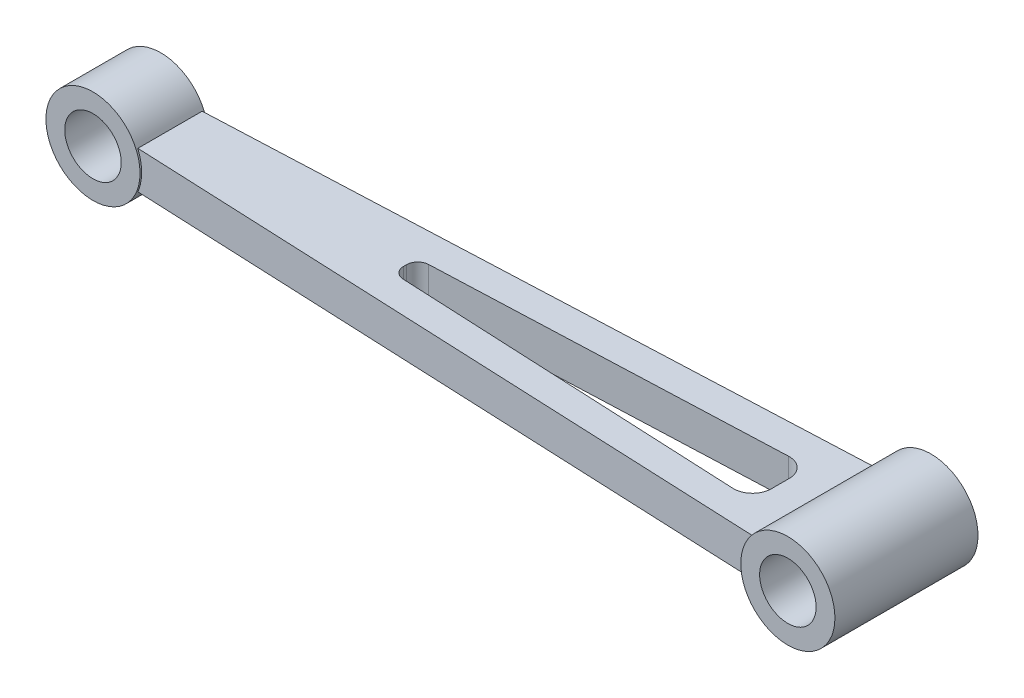
ISO-10303-21;
HEADER;
FILE_DESCRIPTION(('STEP AP214'),'2;1');
FILE_NAME('part.step','',(''),(''),'','','');
FILE_SCHEMA(('AUTOMOTIVE_DESIGN { 1 0 10303 214 1 1 1 1 }'));
ENDSEC;
DATA;
#1=APPLICATION_CONTEXT('core data for automotive mechanical design processes');
#2=APPLICATION_PROTOCOL_DEFINITION('international standard','automotive_design',2000,#1);
#3=PRODUCT_CONTEXT('',#1,'mechanical');
#4=PRODUCT('Part','Part','',(#3));
#5=PRODUCT_RELATED_PRODUCT_CATEGORY('part','',(#4));
#6=PRODUCT_DEFINITION_FORMATION('','',#4);
#7=PRODUCT_DEFINITION_CONTEXT('part definition',#1,'design');
#8=PRODUCT_DEFINITION('design','',#6,#7);
#9=PRODUCT_DEFINITION_SHAPE('','',#8);
#10=(LENGTH_UNIT() NAMED_UNIT(*) SI_UNIT(.MILLI.,.METRE.));
#11=(NAMED_UNIT(*) PLANE_ANGLE_UNIT() SI_UNIT($,.RADIAN.));
#12=(NAMED_UNIT(*) SI_UNIT($,.STERADIAN.) SOLID_ANGLE_UNIT());
#13=UNCERTAINTY_MEASURE_WITH_UNIT(LENGTH_MEASURE(1.E-05),#10,'distance_accuracy_value','');
#14=(GEOMETRIC_REPRESENTATION_CONTEXT(3) GLOBAL_UNCERTAINTY_ASSIGNED_CONTEXT((#13)) GLOBAL_UNIT_ASSIGNED_CONTEXT((#10,
#11,#12)) REPRESENTATION_CONTEXT('',''));
#15=CARTESIAN_POINT('',(0.,0.,0.));
#16=DIRECTION('',(0.,0.,1.));
#17=DIRECTION('',(1.,0.,0.));
#18=AXIS2_PLACEMENT_3D('',#15,#16,#17);
#19=CARTESIAN_POINT('',(194.56,0.,19.));
#20=DIRECTION('',(0.,0.,-1.));
#21=DIRECTION('',(-1.,0.,0.));
#22=AXIS2_PLACEMENT_3D('',#19,#20,#21);
#23=CYLINDRICAL_SURFACE('',#22,12.5);
#24=CARTESIAN_POINT('',(194.56,0.,-19.));
#25=DIRECTION('',(0.,0.,1.));
#26=DIRECTION('',(1.,0.,0.));
#27=AXIS2_PLACEMENT_3D('',#24,#25,#26);
#28=CIRCLE('',#27,12.5);
#29=CARTESIAN_POINT('',(207.06,0.,-19.));
#30=VERTEX_POINT('',#29);
#31=EDGE_CURVE('E171',#30,#30,#28,.T.);
#32=ORIENTED_EDGE('',*,*,#31,.T.);
#33=EDGE_LOOP('',(#32));
#34=FACE_BOUND('',#33,.T.);
#35=CARTESIAN_POINT('',(194.56,0.,19.));
#36=DIRECTION('',(0.,0.,1.));
#37=DIRECTION('',(1.,0.,0.));
#38=AXIS2_PLACEMENT_3D('',#35,#36,#37);
#39=CIRCLE('',#38,12.5);
#40=CARTESIAN_POINT('',(207.06,0.,19.));
#41=VERTEX_POINT('',#40);
#42=EDGE_CURVE('E170',#41,#41,#39,.T.);
#43=ORIENTED_EDGE('',*,*,#42,.F.);
#44=EDGE_LOOP('',(#43));
#45=FACE_BOUND('',#44,.T.);
#46=CARTESIAN_POINT('',(194.56,0.,16.532346479753));
#47=DIRECTION('',(0.0436345464307916,0.,-0.999047559607539));
#48=DIRECTION('',(-0.999047559607539,0.,-0.0436345464307916));
#49=AXIS2_PLACEMENT_3D('',#46,#47,#48);
#50=ELLIPSE('',#49,12.5119168549998,12.5);
#51=CARTESIAN_POINT('',(183.10356076261,-5.,16.0319733743607));
#52=VERTEX_POINT('',#51);
#53=CARTESIAN_POINT('',(183.10356076261,5.,16.0319733743607));
#54=VERTEX_POINT('',#53);
#55=EDGE_CURVE('E127',#52,#54,#50,.T.);
#56=ORIENTED_EDGE('',*,*,#55,.F.);
#57=DIRECTION('',(0.,0.,-1.));
#58=VECTOR('',#57,1.);
#59=CARTESIAN_POINT('',(183.10356076261,-5.,19.));
#60=LINE('',#59,#58);
#61=CARTESIAN_POINT('',(183.10356076261,-5.,-16.0273182798147));
#62=VERTEX_POINT('',#61);
#63=EDGE_CURVE('E165',#52,#62,#60,.T.);
#64=ORIENTED_EDGE('',*,*,#63,.T.);
#65=CARTESIAN_POINT('',(194.56,0.,-16.5273430536101));
#66=DIRECTION('',(0.0436042282898308,0.,0.999048883326161));
#67=DIRECTION('',(0.999048883326161,0.,-0.0436042282898308));
#68=AXIS2_PLACEMENT_3D('',#65,#66,#67);
#69=ELLIPSE('',#68,12.5119002769749,12.5);
#70=CARTESIAN_POINT('',(183.10356076261,5.,-16.0273182798147));
#71=VERTEX_POINT('',#70);
#72=EDGE_CURVE('E167',#71,#62,#69,.T.);
#73=ORIENTED_EDGE('',*,*,#72,.F.);
#74=DIRECTION('',(0.,0.,-1.));
#75=VECTOR('',#74,1.);
#76=CARTESIAN_POINT('',(183.10356076261,5.,19.));
#77=LINE('',#76,#75);
#78=EDGE_CURVE('E162',#54,#71,#77,.T.);
#79=ORIENTED_EDGE('',*,*,#78,.F.);
#80=EDGE_LOOP('',(#56,#64,#73,#79));
#81=FACE_BOUND('',#80,.T.);
#82=ADVANCED_FACE('F36',(#34,#45,#81),#23,.T.);
#83=CARTESIAN_POINT('',(194.56,0.,19.));
#84=DIRECTION('',(0.,0.,1.));
#85=DIRECTION('',(1.,0.,0.));
#86=AXIS2_PLACEMENT_3D('',#83,#84,#85);
#87=PLANE('',#86);
#88=CARTESIAN_POINT('',(194.56,0.,19.));
#89=DIRECTION('',(0.,0.,1.));
#90=DIRECTION('',(1.,0.,0.));
#91=AXIS2_PLACEMENT_3D('',#88,#89,#90);
#92=CIRCLE('',#91,7.50000000000001);
#93=CARTESIAN_POINT('',(202.06,0.,19.));
#94=VERTEX_POINT('',#93);
#95=EDGE_CURVE('E159',#94,#94,#92,.T.);
#96=ORIENTED_EDGE('',*,*,#95,.F.);
#97=EDGE_LOOP('',(#96));
#98=FACE_BOUND('',#97,.T.);
#99=ORIENTED_EDGE('',*,*,#42,.T.);
#100=EDGE_LOOP('',(#99));
#101=FACE_BOUND('',#100,.T.);
#102=ADVANCED_FACE('F277',(#98,#101),#87,.T.);
#103=CARTESIAN_POINT('',(194.56,0.,-19.));
#104=DIRECTION('',(0.,0.,1.));
#105=DIRECTION('',(1.,0.,0.));
#106=AXIS2_PLACEMENT_3D('',#103,#104,#105);
#107=PLANE('',#106);
#108=CARTESIAN_POINT('',(194.56,0.,-19.));
#109=DIRECTION('',(0.,0.,1.));
#110=DIRECTION('',(1.,0.,0.));
#111=AXIS2_PLACEMENT_3D('',#108,#109,#110);
#112=CIRCLE('',#111,7.50000000000001);
#113=CARTESIAN_POINT('',(202.06,0.,-19.));
#114=VERTEX_POINT('',#113);
#115=EDGE_CURVE('E205',#114,#114,#112,.T.);
#116=ORIENTED_EDGE('',*,*,#115,.T.);
#117=EDGE_LOOP('',(#116));
#118=FACE_BOUND('',#117,.T.);
#119=ORIENTED_EDGE('',*,*,#31,.F.);
#120=EDGE_LOOP('',(#119));
#121=FACE_BOUND('',#120,.T.);
#122=ADVANCED_FACE('F38',(#118,#121),#107,.F.);
#123=CARTESIAN_POINT('',(0.,5.,0.));
#124=DIRECTION('',(0.,-1.,0.));
#125=DIRECTION('',(0.,0.,-1.));
#126=AXIS2_PLACEMENT_3D('',#123,#124,#125);
#127=PLANE('',#126);
#128=DIRECTION('',(0.,0.,1.));
#129=VECTOR('',#128,1.);
#130=CARTESIAN_POINT('',(173.89,5.,0.));
#131=LINE('',#130,#129);
#132=CARTESIAN_POINT('',(173.89,5.,-2.07154139846305));
#133=VERTEX_POINT('',#132);
#134=CARTESIAN_POINT('',(173.89,5.,2.7218638955506));
#135=VERTEX_POINT('',#134);
#136=EDGE_CURVE('E229',#133,#135,#131,.T.);
#137=ORIENTED_EDGE('',*,*,#136,.T.);
#138=CARTESIAN_POINT('',(168.89,5.,2.72186389555063));
#139=DIRECTION('',(0.,-1.,0.));
#140=DIRECTION('',(0.,0.,-1.));
#141=AXIS2_PLACEMENT_3D('',#138,#139,#140);
#142=CIRCLE('',#141,5.);
#143=CARTESIAN_POINT('',(168.654835057269,5.,7.71633057876218));
#144=VERTEX_POINT('',#143);
#145=EDGE_CURVE('E134',#135,#144,#142,.T.);
#146=ORIENTED_EDGE('',*,*,#145,.T.);
#147=DIRECTION('',(-0.99889333664231,0.,-0.0470329885462605));
#148=VECTOR('',#147,1.);
#149=CARTESIAN_POINT('',(0.01056124474112,5.,-0.224301226110203));
#150=LINE('',#149,#148);
#151=CARTESIAN_POINT('',(76.7489010343612,5.,3.3889308618286));
#152=VERTEX_POINT('',#151);
#153=EDGE_CURVE('E211',#144,#152,#150,.T.);
#154=ORIENTED_EDGE('',*,*,#153,.T.);
#155=CARTESIAN_POINT('',(76.89,5.,0.392250851901667));
#156=DIRECTION('',(0.,-1.,0.));
#157=DIRECTION('',(0.,0.,-1.));
#158=AXIS2_PLACEMENT_3D('',#155,#156,#157);
#159=CIRCLE('',#158,3.);
#160=CARTESIAN_POINT('',(73.89,5.,0.392250851901647));
#161=VERTEX_POINT('',#160);
#162=EDGE_CURVE('E214',#152,#161,#159,.T.);
#163=ORIENTED_EDGE('',*,*,#162,.T.);
#164=DIRECTION('',(0.,0.,-1.));
#165=VECTOR('',#164,1.);
#166=CARTESIAN_POINT('',(73.89,5.,0.));
#167=LINE('',#166,#165);
#168=CARTESIAN_POINT('',(73.89,5.,-0.371281166993813));
#169=VERTEX_POINT('',#168);
#170=EDGE_CURVE('E217',#161,#169,#167,.T.);
#171=ORIENTED_EDGE('',*,*,#170,.T.);
#172=CARTESIAN_POINT('',(76.89,5.,-0.371281166993835));
#173=DIRECTION('',(0.,-1.,0.));
#174=DIRECTION('',(0.,0.,-1.));
#175=AXIS2_PLACEMENT_3D('',#172,#173,#174);
#176=CIRCLE('',#175,3.);
#177=CARTESIAN_POINT('',(76.7693841694334,5.,-3.36885548991174));
#178=VERTEX_POINT('',#177);
#179=EDGE_CURVE('E220',#169,#178,#176,.T.);
#180=ORIENTED_EDGE('',*,*,#179,.T.);
#181=DIRECTION('',(0.999191440972634,0.,-0.040205276855546));
#182=VECTOR('',#181,1.);
#183=CARTESIAN_POINT('',(-0.011241283912809,5.,-0.27937115596986));
#184=LINE('',#183,#182);
#185=CARTESIAN_POINT('',(168.688973615722,5.,-7.06749860332626));
#186=VERTEX_POINT('',#185);
#187=EDGE_CURVE('E223',#178,#186,#184,.T.);
#188=ORIENTED_EDGE('',*,*,#187,.T.);
#189=CARTESIAN_POINT('',(168.89,5.,-2.07154139846309));
#190=DIRECTION('',(0.,-1.,0.));
#191=DIRECTION('',(0.,0.,-1.));
#192=AXIS2_PLACEMENT_3D('',#189,#190,#191);
#193=CIRCLE('',#192,5.);
#194=EDGE_CURVE('E226',#186,#133,#193,.T.);
#195=ORIENTED_EDGE('',*,*,#194,.T.);
#196=EDGE_LOOP('',(#137,#146,#154,#163,#171,#180,#188,#195));
#197=FACE_BOUND('',#196,.T.);
#198=DIRECTION('',(0.999047559607539,0.,0.0436345464307916));
#199=VECTOR('',#198,1.);
#200=CARTESIAN_POINT('',(187.06,5.,16.2047753895844));
#201=LINE('',#200,#199);
#202=CARTESIAN_POINT('',(11.4564392373896,5.,8.53508874471783));
#203=VERTEX_POINT('',#202);
#204=EDGE_CURVE('E196',#203,#54,#201,.T.);
#205=ORIENTED_EDGE('',*,*,#204,.T.);
#206=ORIENTED_EDGE('',*,*,#78,.T.);
#207=DIRECTION('',(-0.99904888332616,0.,0.0436042282898308));
#208=VECTOR('',#207,1.);
#209=CARTESIAN_POINT('',(7.5,5.,-8.36297083916975));
#210=LINE('',#209,#208);
#211=CARTESIAN_POINT('',(11.4564392373896,5.,-8.53565255935506));
#212=VERTEX_POINT('',#211);
#213=EDGE_CURVE('E191',#71,#212,#210,.T.);
#214=ORIENTED_EDGE('',*,*,#213,.T.);
#215=DIRECTION('',(0.,0.,-1.));
#216=VECTOR('',#215,1.);
#217=CARTESIAN_POINT('',(11.4564392373896,5.,9.));
#218=LINE('',#217,#216);
#219=EDGE_CURVE('E174',#212,#203,#218,.F.);
#220=ORIENTED_EDGE('',*,*,#219,.T.);
#221=EDGE_LOOP('',(#205,#206,#214,#220));
#222=FACE_BOUND('',#221,.T.);
#223=ADVANCED_FACE('F248',(#197,#222),#127,.F.);
#224=CARTESIAN_POINT('',(0.,-5.,0.));
#225=DIRECTION('',(0.,-1.,0.));
#226=DIRECTION('',(0.,0.,-1.));
#227=AXIS2_PLACEMENT_3D('',#224,#225,#226);
#228=PLANE('',#227);
#229=CARTESIAN_POINT('',(168.89,-5.,2.72186389555063));
#230=DIRECTION('',(0.,-1.,0.));
#231=DIRECTION('',(0.,0.,-1.));
#232=AXIS2_PLACEMENT_3D('',#229,#230,#231);
#233=CIRCLE('',#232,5.);
#234=CARTESIAN_POINT('',(173.89,-5.,2.7218638955506));
#235=VERTEX_POINT('',#234);
#236=CARTESIAN_POINT('',(168.654835057269,-5.,7.71633057876218));
#237=VERTEX_POINT('',#236);
#238=EDGE_CURVE('E11',#235,#237,#233,.T.);
#239=ORIENTED_EDGE('',*,*,#238,.F.);
#240=DIRECTION('',(0.,0.,1.));
#241=VECTOR('',#240,1.);
#242=CARTESIAN_POINT('',(173.89,-5.,0.));
#243=LINE('',#242,#241);
#244=CARTESIAN_POINT('',(173.89,-5.,-2.07154139846305));
#245=VERTEX_POINT('',#244);
#246=EDGE_CURVE('E121',#245,#235,#243,.T.);
#247=ORIENTED_EDGE('',*,*,#246,.F.);
#248=CARTESIAN_POINT('',(168.89,-5.,-2.07154139846309));
#249=DIRECTION('',(0.,-1.,0.));
#250=DIRECTION('',(0.,0.,-1.));
#251=AXIS2_PLACEMENT_3D('',#248,#249,#250);
#252=CIRCLE('',#251,5.);
#253=CARTESIAN_POINT('',(168.688973615722,-5.,-7.06749860332626));
#254=VERTEX_POINT('',#253);
#255=EDGE_CURVE('E126',#254,#245,#252,.T.);
#256=ORIENTED_EDGE('',*,*,#255,.F.);
#257=DIRECTION('',(0.999191440972634,0.,-0.040205276855546));
#258=VECTOR('',#257,1.);
#259=CARTESIAN_POINT('',(-0.011241283912809,-5.,-0.27937115596986));
#260=LINE('',#259,#258);
#261=CARTESIAN_POINT('',(76.7693841694334,-5.,-3.36885548991174));
#262=VERTEX_POINT('',#261);
#263=EDGE_CURVE('E152',#262,#254,#260,.T.);
#264=ORIENTED_EDGE('',*,*,#263,.F.);
#265=CARTESIAN_POINT('',(76.89,-5.,-0.371281166993835));
#266=DIRECTION('',(0.,-1.,0.));
#267=DIRECTION('',(0.,0.,-1.));
#268=AXIS2_PLACEMENT_3D('',#265,#266,#267);
#269=CIRCLE('',#268,3.);
#270=CARTESIAN_POINT('',(73.89,-5.,-0.371281166993813));
#271=VERTEX_POINT('',#270);
#272=EDGE_CURVE('E150',#271,#262,#269,.T.);
#273=ORIENTED_EDGE('',*,*,#272,.F.);
#274=DIRECTION('',(0.,0.,-1.));
#275=VECTOR('',#274,1.);
#276=CARTESIAN_POINT('',(73.89,-5.,0.));
#277=LINE('',#276,#275);
#278=CARTESIAN_POINT('',(73.89,-5.,0.392250851901647));
#279=VERTEX_POINT('',#278);
#280=EDGE_CURVE('E146',#279,#271,#277,.T.);
#281=ORIENTED_EDGE('',*,*,#280,.F.);
#282=CARTESIAN_POINT('',(76.89,-5.,0.392250851901667));
#283=DIRECTION('',(0.,-1.,0.));
#284=DIRECTION('',(0.,0.,-1.));
#285=AXIS2_PLACEMENT_3D('',#282,#283,#284);
#286=CIRCLE('',#285,3.);
#287=CARTESIAN_POINT('',(76.7489010343612,-5.,3.3889308618286));
#288=VERTEX_POINT('',#287);
#289=EDGE_CURVE('E142',#288,#279,#286,.T.);
#290=ORIENTED_EDGE('',*,*,#289,.F.);
#291=DIRECTION('',(-0.99889333664231,0.,-0.0470329885462605));
#292=VECTOR('',#291,1.);
#293=CARTESIAN_POINT('',(0.01056124474112,-5.,-0.224301226110203));
#294=LINE('',#293,#292);
#295=EDGE_CURVE('E44',#237,#288,#294,.T.);
#296=ORIENTED_EDGE('',*,*,#295,.F.);
#297=EDGE_LOOP('',(#239,#247,#256,#264,#273,#281,#290,#296));
#298=FACE_BOUND('',#297,.T.);
#299=ORIENTED_EDGE('',*,*,#63,.F.);
#300=DIRECTION('',(0.999047559607539,0.,0.0436345464307916));
#301=VECTOR('',#300,1.);
#302=CARTESIAN_POINT('',(187.06,-5.,16.2047753895844));
#303=LINE('',#302,#301);
#304=CARTESIAN_POINT('',(11.4564392373896,-5.,8.53508874471783));
#305=VERTEX_POINT('',#304);
#306=EDGE_CURVE('E197',#305,#52,#303,.T.);
#307=ORIENTED_EDGE('',*,*,#306,.F.);
#308=DIRECTION('',(0.,0.,-1.));
#309=VECTOR('',#308,1.);
#310=CARTESIAN_POINT('',(11.4564392373896,-5.,9.));
#311=LINE('',#310,#309);
#312=CARTESIAN_POINT('',(11.4564392373896,-5.,-8.53565255935506));
#313=VERTEX_POINT('',#312);
#314=EDGE_CURVE('E184',#313,#305,#311,.F.);
#315=ORIENTED_EDGE('',*,*,#314,.F.);
#316=DIRECTION('',(-0.99904888332616,0.,0.0436042282898308));
#317=VECTOR('',#316,1.);
#318=CARTESIAN_POINT('',(7.5,-5.,-8.36297083916975));
#319=LINE('',#318,#317);
#320=EDGE_CURVE('E194',#62,#313,#319,.T.);
#321=ORIENTED_EDGE('',*,*,#320,.F.);
#322=EDGE_LOOP('',(#299,#307,#315,#321));
#323=FACE_BOUND('',#322,.T.);
#324=ADVANCED_FACE('F138',(#298,#323),#228,.T.);
#325=CARTESIAN_POINT('',(0.,0.,9.));
#326=DIRECTION('',(0.,0.,-1.));
#327=DIRECTION('',(-1.,0.,0.));
#328=AXIS2_PLACEMENT_3D('',#325,#326,#327);
#329=CYLINDRICAL_SURFACE('',#328,12.5);
#330=CARTESIAN_POINT('',(0.,0.,-9.));
#331=DIRECTION('',(0.,0.,1.));
#332=DIRECTION('',(1.,0.,0.));
#333=AXIS2_PLACEMENT_3D('',#330,#331,#332);
#334=CIRCLE('',#333,12.5);
#335=CARTESIAN_POINT('',(12.5,0.,-9.));
#336=VERTEX_POINT('',#335);
#337=EDGE_CURVE('E188',#336,#336,#334,.T.);
#338=ORIENTED_EDGE('',*,*,#337,.T.);
#339=EDGE_LOOP('',(#338));
#340=FACE_BOUND('',#339,.T.);
#341=CARTESIAN_POINT('',(0.,0.,9.));
#342=DIRECTION('',(0.,0.,1.));
#343=DIRECTION('',(1.,0.,0.));
#344=AXIS2_PLACEMENT_3D('',#341,#342,#343);
#345=CIRCLE('',#344,12.5);
#346=CARTESIAN_POINT('',(12.5,0.,9.));
#347=VERTEX_POINT('',#346);
#348=EDGE_CURVE('E187',#347,#347,#345,.T.);
#349=ORIENTED_EDGE('',*,*,#348,.F.);
#350=EDGE_LOOP('',(#349));
#351=FACE_BOUND('',#350,.T.);
#352=ORIENTED_EDGE('',*,*,#219,.F.);
#353=CARTESIAN_POINT('',(0.,0.,-8.03562778555966));
#354=DIRECTION('',(0.0436042282898308,0.,0.999048883326161));
#355=DIRECTION('',(0.999048883326161,0.,-0.0436042282898308));
#356=AXIS2_PLACEMENT_3D('',#353,#354,#355);
#357=ELLIPSE('',#356,12.5119002769748,12.5);
#358=EDGE_CURVE('E181',#313,#212,#357,.T.);
#359=ORIENTED_EDGE('',*,*,#358,.F.);
#360=ORIENTED_EDGE('',*,*,#314,.T.);
#361=CARTESIAN_POINT('',(0.,0.,8.03471563932554));
#362=DIRECTION('',(0.0436345464307916,0.,-0.999047559607539));
#363=DIRECTION('',(-0.999047559607539,0.,-0.0436345464307916));
#364=AXIS2_PLACEMENT_3D('',#361,#362,#363);
#365=ELLIPSE('',#364,12.5119168549998,12.5);
#366=EDGE_CURVE('E178',#203,#305,#365,.T.);
#367=ORIENTED_EDGE('',*,*,#366,.F.);
#368=EDGE_LOOP('',(#352,#359,#360,#367));
#369=FACE_BOUND('',#368,.T.);
#370=ADVANCED_FACE('F294',(#340,#351,#369),#329,.T.);
#371=CARTESIAN_POINT('',(0.,0.,9.));
#372=DIRECTION('',(0.,0.,1.));
#373=DIRECTION('',(1.,0.,0.));
#374=AXIS2_PLACEMENT_3D('',#371,#372,#373);
#375=PLANE('',#374);
#376=CARTESIAN_POINT('',(0.,0.,9.));
#377=DIRECTION('',(0.,0.,1.));
#378=DIRECTION('',(1.,0.,0.));
#379=AXIS2_PLACEMENT_3D('',#376,#377,#378);
#380=CIRCLE('',#379,7.5);
#381=CARTESIAN_POINT('',(7.5,0.,9.));
#382=VERTEX_POINT('',#381);
#383=EDGE_CURVE('E158',#382,#382,#380,.T.);
#384=ORIENTED_EDGE('',*,*,#383,.F.);
#385=EDGE_LOOP('',(#384));
#386=FACE_BOUND('',#385,.T.);
#387=ORIENTED_EDGE('',*,*,#348,.T.);
#388=EDGE_LOOP('',(#387));
#389=FACE_BOUND('',#388,.T.);
#390=ADVANCED_FACE('F290',(#386,#389),#375,.T.);
#391=CARTESIAN_POINT('',(0.,0.,-9.));
#392=DIRECTION('',(0.,0.,1.));
#393=DIRECTION('',(1.,0.,0.));
#394=AXIS2_PLACEMENT_3D('',#391,#392,#393);
#395=PLANE('',#394);
#396=CARTESIAN_POINT('',(0.,0.,-9.));
#397=DIRECTION('',(0.,0.,1.));
#398=DIRECTION('',(1.,0.,0.));
#399=AXIS2_PLACEMENT_3D('',#396,#397,#398);
#400=CIRCLE('',#399,7.5);
#401=CARTESIAN_POINT('',(7.5,0.,-9.));
#402=VERTEX_POINT('',#401);
#403=EDGE_CURVE('E155',#402,#402,#400,.T.);
#404=ORIENTED_EDGE('',*,*,#403,.T.);
#405=EDGE_LOOP('',(#404));
#406=FACE_BOUND('',#405,.T.);
#407=ORIENTED_EDGE('',*,*,#337,.F.);
#408=EDGE_LOOP('',(#407));
#409=FACE_BOUND('',#408,.T.);
#410=ADVANCED_FACE('F286',(#406,#409),#395,.F.);
#411=CARTESIAN_POINT('',(187.06,5.,16.2047753895844));
#412=DIRECTION('',(0.0436345464307916,0.,-0.999047559607539));
#413=DIRECTION('',(-0.999047559607539,0.,-0.0436345464307916));
#414=AXIS2_PLACEMENT_3D('',#411,#412,#413);
#415=PLANE('',#414);
#416=ORIENTED_EDGE('',*,*,#306,.T.);
#417=ORIENTED_EDGE('',*,*,#55,.T.);
#418=ORIENTED_EDGE('',*,*,#204,.F.);
#419=ORIENTED_EDGE('',*,*,#366,.T.);
#420=EDGE_LOOP('',(#416,#417,#418,#419));
#421=FACE_BOUND('',#420,.T.);
#422=ADVANCED_FACE('F289',(#421),#415,.F.);
#423=CARTESIAN_POINT('',(7.5,5.,-8.36297083916975));
#424=DIRECTION('',(0.0436042282898308,0.,0.999048883326161));
#425=DIRECTION('',(0.999048883326161,0.,-0.0436042282898308));
#426=AXIS2_PLACEMENT_3D('',#423,#424,#425);
#427=PLANE('',#426);
#428=ORIENTED_EDGE('',*,*,#213,.F.);
#429=ORIENTED_EDGE('',*,*,#72,.T.);
#430=ORIENTED_EDGE('',*,*,#320,.T.);
#431=ORIENTED_EDGE('',*,*,#358,.T.);
#432=EDGE_LOOP('',(#428,#429,#430,#431));
#433=FACE_BOUND('',#432,.T.);
#434=ADVANCED_FACE('F301',(#433),#427,.F.);
#435=CARTESIAN_POINT('',(0.,0.,-19.));
#436=DIRECTION('',(0.,0.,1.));
#437=DIRECTION('',(1.,0.,0.));
#438=AXIS2_PLACEMENT_3D('',#435,#436,#437);
#439=CYLINDRICAL_SURFACE('',#438,7.5);
#440=ORIENTED_EDGE('',*,*,#383,.T.);
#441=EDGE_LOOP('',(#440));
#442=FACE_BOUND('',#441,.T.);
#443=ORIENTED_EDGE('',*,*,#403,.F.);
#444=EDGE_LOOP('',(#443));
#445=FACE_BOUND('',#444,.T.);
#446=ADVANCED_FACE('F305',(#442,#445),#439,.F.);
#447=CARTESIAN_POINT('',(194.56,0.,-19.));
#448=DIRECTION('',(0.,0.,1.));
#449=DIRECTION('',(1.,0.,0.));
#450=AXIS2_PLACEMENT_3D('',#447,#448,#449);
#451=CYLINDRICAL_SURFACE('',#450,7.50000000000001);
#452=ORIENTED_EDGE('',*,*,#115,.F.);
#453=EDGE_LOOP('',(#452));
#454=FACE_BOUND('',#453,.T.);
#455=ORIENTED_EDGE('',*,*,#95,.T.);
#456=EDGE_LOOP('',(#455));
#457=FACE_BOUND('',#456,.T.);
#458=ADVANCED_FACE('F274',(#454,#457),#451,.F.);
#459=CARTESIAN_POINT('',(168.89,-14.,2.72186389555063));
#460=DIRECTION('',(0.,1.,0.));
#461=DIRECTION('',(0.,0.,1.));
#462=AXIS2_PLACEMENT_3D('',#459,#460,#461);
#463=CYLINDRICAL_SURFACE('',#462,5.);
#464=DIRECTION('',(0.,1.,0.));
#465=VECTOR('',#464,1.);
#466=CARTESIAN_POINT('',(173.89,-14.,2.7218638955506));
#467=LINE('',#466,#465);
#468=EDGE_CURVE('E51',#235,#135,#467,.T.);
#469=ORIENTED_EDGE('',*,*,#468,.F.);
#470=ORIENTED_EDGE('',*,*,#238,.T.);
#471=DIRECTION('',(0.,1.,0.));
#472=VECTOR('',#471,1.);
#473=CARTESIAN_POINT('',(168.654835057269,-14.,7.71633057876218));
#474=LINE('',#473,#472);
#475=EDGE_CURVE('E230',#237,#144,#474,.T.);
#476=ORIENTED_EDGE('',*,*,#475,.T.);
#477=ORIENTED_EDGE('',*,*,#145,.F.);
#478=EDGE_LOOP('',(#469,#470,#476,#477));
#479=FACE_BOUND('',#478,.T.);
#480=ADVANCED_FACE('F130',(#479),#463,.F.);
#481=CARTESIAN_POINT('',(168.654835057269,-14.,7.71633057876218));
#482=DIRECTION('',(-0.0470329885462605,0.,0.99889333664231));
#483=DIRECTION('',(0.99889333664231,0.,0.0470329885462605));
#484=AXIS2_PLACEMENT_3D('',#481,#482,#483);
#485=PLANE('',#484);
#486=ORIENTED_EDGE('',*,*,#475,.F.);
#487=ORIENTED_EDGE('',*,*,#295,.T.);
#488=DIRECTION('',(0.,1.,0.));
#489=VECTOR('',#488,1.);
#490=CARTESIAN_POINT('',(76.7489010343612,-14.,3.3889308618286));
#491=LINE('',#490,#489);
#492=EDGE_CURVE('E245',#288,#152,#491,.T.);
#493=ORIENTED_EDGE('',*,*,#492,.T.);
#494=ORIENTED_EDGE('',*,*,#153,.F.);
#495=EDGE_LOOP('',(#486,#487,#493,#494));
#496=FACE_BOUND('',#495,.T.);
#497=ADVANCED_FACE('F266',(#496),#485,.F.);
#498=CARTESIAN_POINT('',(76.89,-14.,0.392250851901667));
#499=DIRECTION('',(0.,1.,0.));
#500=DIRECTION('',(0.,0.,1.));
#501=AXIS2_PLACEMENT_3D('',#498,#499,#500);
#502=CYLINDRICAL_SURFACE('',#501,3.);
#503=ORIENTED_EDGE('',*,*,#492,.F.);
#504=ORIENTED_EDGE('',*,*,#289,.T.);
#505=DIRECTION('',(0.,1.,0.));
#506=VECTOR('',#505,1.);
#507=CARTESIAN_POINT('',(73.89,-14.,0.392250851901647));
#508=LINE('',#507,#506);
#509=EDGE_CURVE('E242',#279,#161,#508,.T.);
#510=ORIENTED_EDGE('',*,*,#509,.T.);
#511=ORIENTED_EDGE('',*,*,#162,.F.);
#512=EDGE_LOOP('',(#503,#504,#510,#511));
#513=FACE_BOUND('',#512,.T.);
#514=ADVANCED_FACE('F265',(#513),#502,.F.);
#515=CARTESIAN_POINT('',(73.89,-14.,0.392250851901647));
#516=DIRECTION('',(-1.,0.,0.));
#517=DIRECTION('',(0.,0.,1.));
#518=AXIS2_PLACEMENT_3D('',#515,#516,#517);
#519=PLANE('',#518);
#520=ORIENTED_EDGE('',*,*,#509,.F.);
#521=ORIENTED_EDGE('',*,*,#280,.T.);
#522=DIRECTION('',(0.,1.,0.));
#523=VECTOR('',#522,1.);
#524=CARTESIAN_POINT('',(73.89,-14.,-0.371281166993813));
#525=LINE('',#524,#523);
#526=EDGE_CURVE('E239',#271,#169,#525,.T.);
#527=ORIENTED_EDGE('',*,*,#526,.T.);
#528=ORIENTED_EDGE('',*,*,#170,.F.);
#529=EDGE_LOOP('',(#520,#521,#527,#528));
#530=FACE_BOUND('',#529,.T.);
#531=ADVANCED_FACE('F263',(#530),#519,.F.);
#532=CARTESIAN_POINT('',(76.89,-14.,-0.371281166993835));
#533=DIRECTION('',(0.,1.,0.));
#534=DIRECTION('',(0.,0.,1.));
#535=AXIS2_PLACEMENT_3D('',#532,#533,#534);
#536=CYLINDRICAL_SURFACE('',#535,3.);
#537=ORIENTED_EDGE('',*,*,#526,.F.);
#538=ORIENTED_EDGE('',*,*,#272,.T.);
#539=DIRECTION('',(0.,1.,0.));
#540=VECTOR('',#539,1.);
#541=CARTESIAN_POINT('',(76.7693841694334,-14.,-3.36885548991174));
#542=LINE('',#541,#540);
#543=EDGE_CURVE('E236',#262,#178,#542,.T.);
#544=ORIENTED_EDGE('',*,*,#543,.T.);
#545=ORIENTED_EDGE('',*,*,#179,.F.);
#546=EDGE_LOOP('',(#537,#538,#544,#545));
#547=FACE_BOUND('',#546,.T.);
#548=ADVANCED_FACE('F260',(#547),#536,.F.);
#549=CARTESIAN_POINT('',(76.7693841694334,-14.,-3.36885548991174));
#550=DIRECTION('',(-0.040205276855546,0.,-0.999191440972634));
#551=DIRECTION('',(-0.999191440972634,0.,0.040205276855546));
#552=AXIS2_PLACEMENT_3D('',#549,#550,#551);
#553=PLANE('',#552);
#554=ORIENTED_EDGE('',*,*,#543,.F.);
#555=ORIENTED_EDGE('',*,*,#263,.T.);
#556=DIRECTION('',(0.,1.,0.));
#557=VECTOR('',#556,1.);
#558=CARTESIAN_POINT('',(168.688973615722,-14.,-7.06749860332626));
#559=LINE('',#558,#557);
#560=EDGE_CURVE('E233',#254,#186,#559,.T.);
#561=ORIENTED_EDGE('',*,*,#560,.T.);
#562=ORIENTED_EDGE('',*,*,#187,.F.);
#563=EDGE_LOOP('',(#554,#555,#561,#562));
#564=FACE_BOUND('',#563,.T.);
#565=ADVANCED_FACE('F257',(#564),#553,.F.);
#566=CARTESIAN_POINT('',(168.89,-14.,-2.07154139846309));
#567=DIRECTION('',(0.,1.,0.));
#568=DIRECTION('',(0.,0.,1.));
#569=AXIS2_PLACEMENT_3D('',#566,#567,#568);
#570=CYLINDRICAL_SURFACE('',#569,5.);
#571=ORIENTED_EDGE('',*,*,#560,.F.);
#572=ORIENTED_EDGE('',*,*,#255,.T.);
#573=DIRECTION('',(0.,1.,0.));
#574=VECTOR('',#573,1.);
#575=CARTESIAN_POINT('',(173.89,-14.,-2.07154139846305));
#576=LINE('',#575,#574);
#577=EDGE_CURVE('E56',#245,#133,#576,.T.);
#578=ORIENTED_EDGE('',*,*,#577,.T.);
#579=ORIENTED_EDGE('',*,*,#194,.F.);
#580=EDGE_LOOP('',(#571,#572,#578,#579));
#581=FACE_BOUND('',#580,.T.);
#582=ADVANCED_FACE('F252',(#581),#570,.F.);
#583=CARTESIAN_POINT('',(173.89,-14.,-2.07154139846305));
#584=DIRECTION('',(1.,0.,0.));
#585=DIRECTION('',(0.,0.,-1.));
#586=AXIS2_PLACEMENT_3D('',#583,#584,#585);
#587=PLANE('',#586);
#588=ORIENTED_EDGE('',*,*,#577,.F.);
#589=ORIENTED_EDGE('',*,*,#246,.T.);
#590=ORIENTED_EDGE('',*,*,#468,.T.);
#591=ORIENTED_EDGE('',*,*,#136,.F.);
#592=EDGE_LOOP('',(#588,#589,#590,#591));
#593=FACE_BOUND('',#592,.T.);
#594=ADVANCED_FACE('F122',(#593),#587,.F.);
#595=CLOSED_SHELL('',(#82,#102,#122,#223,#324,#370,#390,#410,#422,#434,#446,#458,#480,#497,#514,
#531,#548,#565,#582,#594));
#596=MANIFOLD_SOLID_BREP('B2',#595);
#597=ADVANCED_BREP_SHAPE_REPRESENTATION('',(#18,#596),#14);
#598=SHAPE_DEFINITION_REPRESENTATION(#9,#597);
ENDSEC;
END-ISO-10303-21;
